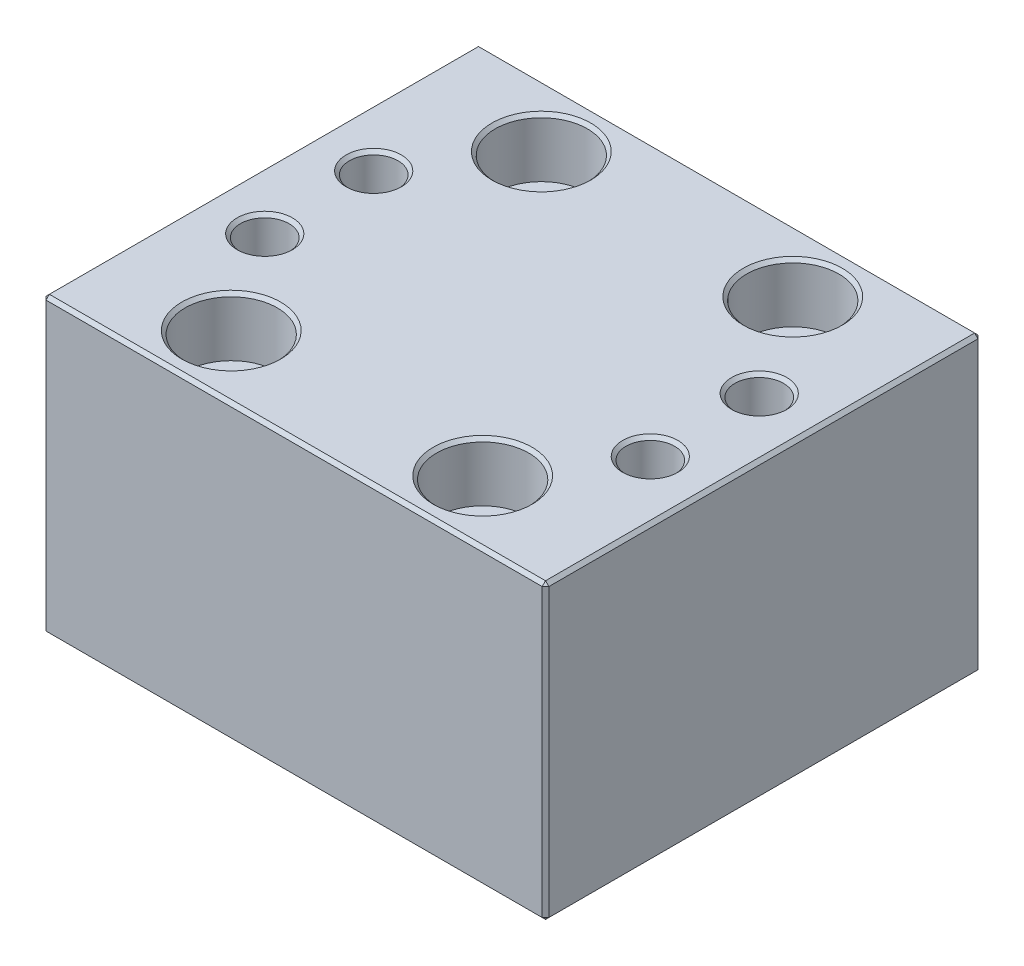
ISO-10303-21;
HEADER;
FILE_DESCRIPTION(('STEP AP214'),'2;1');
FILE_NAME('part.step','',(''),(''),'','','');
FILE_SCHEMA(('AUTOMOTIVE_DESIGN { 1 0 10303 214 1 1 1 1 }'));
ENDSEC;
DATA;
#1=APPLICATION_CONTEXT('core data for automotive mechanical design processes');
#2=APPLICATION_PROTOCOL_DEFINITION('international standard','automotive_design',2000,#1);
#3=PRODUCT_CONTEXT('',#1,'mechanical');
#4=PRODUCT('Part','Part','',(#3));
#5=PRODUCT_RELATED_PRODUCT_CATEGORY('part','',(#4));
#6=PRODUCT_DEFINITION_FORMATION('','',#4);
#7=PRODUCT_DEFINITION_CONTEXT('part definition',#1,'design');
#8=PRODUCT_DEFINITION('design','',#6,#7);
#9=PRODUCT_DEFINITION_SHAPE('','',#8);
#10=(LENGTH_UNIT() NAMED_UNIT(*) SI_UNIT(.MILLI.,.METRE.));
#11=(NAMED_UNIT(*) PLANE_ANGLE_UNIT() SI_UNIT($,.RADIAN.));
#12=(NAMED_UNIT(*) SI_UNIT($,.STERADIAN.) SOLID_ANGLE_UNIT());
#13=UNCERTAINTY_MEASURE_WITH_UNIT(LENGTH_MEASURE(1.E-05),#10,'distance_accuracy_value','');
#14=(GEOMETRIC_REPRESENTATION_CONTEXT(3) GLOBAL_UNCERTAINTY_ASSIGNED_CONTEXT((#13)) GLOBAL_UNIT_ASSIGNED_CONTEXT((#10,
#11,#12)) REPRESENTATION_CONTEXT('',''));
#15=CARTESIAN_POINT('',(0.,0.,0.));
#16=DIRECTION('',(0.,0.,1.));
#17=DIRECTION('',(1.,0.,0.));
#18=AXIS2_PLACEMENT_3D('',#15,#16,#17);
#19=CARTESIAN_POINT('',(-15.,35.,-18.5));
#20=DIRECTION('',(0.,-1.,0.));
#21=DIRECTION('',(0.,0.,-1.));
#22=AXIS2_PLACEMENT_3D('',#19,#20,#21);
#23=CYLINDRICAL_SURFACE('',#22,3.05);
#24=CARTESIAN_POINT('',(-15.,0.,-18.5));
#25=DIRECTION('',(0.,1.,0.));
#26=DIRECTION('',(0.,0.,1.));
#27=AXIS2_PLACEMENT_3D('',#24,#25,#26);
#28=CIRCLE('',#27,3.05);
#29=CARTESIAN_POINT('',(-15.,0.,-15.45));
#30=VERTEX_POINT('',#29);
#31=EDGE_CURVE('E319',#30,#30,#28,.T.);
#32=ORIENTED_EDGE('',*,*,#31,.F.);
#33=EDGE_LOOP('',(#32));
#34=FACE_BOUND('',#33,.T.);
#35=CARTESIAN_POINT('',(-15.,28.,-18.5));
#36=DIRECTION('',(0.,1.,0.));
#37=DIRECTION('',(0.,0.,1.));
#38=AXIS2_PLACEMENT_3D('',#35,#36,#37);
#39=CIRCLE('',#38,3.05);
#40=CARTESIAN_POINT('',(-15.,28.,-15.45));
#41=VERTEX_POINT('',#40);
#42=EDGE_CURVE('E313',#41,#41,#39,.T.);
#43=ORIENTED_EDGE('',*,*,#42,.T.);
#44=EDGE_LOOP('',(#43));
#45=FACE_BOUND('',#44,.T.);
#46=ADVANCED_FACE('F36',(#34,#45),#23,.F.);
#47=CARTESIAN_POINT('',(15.,35.,-18.5));
#48=DIRECTION('',(0.,-1.,0.));
#49=DIRECTION('',(0.,0.,-1.));
#50=AXIS2_PLACEMENT_3D('',#47,#48,#49);
#51=CYLINDRICAL_SURFACE('',#50,3.05000000000001);
#52=CARTESIAN_POINT('',(15.,0.,-18.5));
#53=DIRECTION('',(0.,1.,0.));
#54=DIRECTION('',(0.,0.,1.));
#55=AXIS2_PLACEMENT_3D('',#52,#53,#54);
#56=CIRCLE('',#55,3.05000000000001);
#57=CARTESIAN_POINT('',(15.,0.,-15.45));
#58=VERTEX_POINT('',#57);
#59=EDGE_CURVE('E316',#58,#58,#56,.T.);
#60=ORIENTED_EDGE('',*,*,#59,.F.);
#61=EDGE_LOOP('',(#60));
#62=FACE_BOUND('',#61,.T.);
#63=CARTESIAN_POINT('',(15.,28.,-18.5));
#64=DIRECTION('',(0.,1.,0.));
#65=DIRECTION('',(0.,0.,1.));
#66=AXIS2_PLACEMENT_3D('',#63,#64,#65);
#67=CIRCLE('',#66,3.05000000000001);
#68=CARTESIAN_POINT('',(15.,28.,-15.45));
#69=VERTEX_POINT('',#68);
#70=EDGE_CURVE('E340',#69,#69,#67,.T.);
#71=ORIENTED_EDGE('',*,*,#70,.T.);
#72=EDGE_LOOP('',(#71));
#73=FACE_BOUND('',#72,.T.);
#74=ADVANCED_FACE('F407',(#62,#73),#51,.F.);
#75=CARTESIAN_POINT('',(15.,35.,18.5));
#76=DIRECTION('',(0.,-1.,0.));
#77=DIRECTION('',(0.,0.,-1.));
#78=AXIS2_PLACEMENT_3D('',#75,#76,#77);
#79=CYLINDRICAL_SURFACE('',#78,3.05000000000001);
#80=CARTESIAN_POINT('',(15.,0.,18.5));
#81=DIRECTION('',(0.,1.,0.));
#82=DIRECTION('',(0.,0.,1.));
#83=AXIS2_PLACEMENT_3D('',#80,#81,#82);
#84=CIRCLE('',#83,3.05000000000001);
#85=CARTESIAN_POINT('',(15.,0.,21.55));
#86=VERTEX_POINT('',#85);
#87=EDGE_CURVE('E312',#86,#86,#84,.T.);
#88=ORIENTED_EDGE('',*,*,#87,.F.);
#89=EDGE_LOOP('',(#88));
#90=FACE_BOUND('',#89,.T.);
#91=CARTESIAN_POINT('',(15.,28.,18.5));
#92=DIRECTION('',(0.,1.,0.));
#93=DIRECTION('',(0.,0.,1.));
#94=AXIS2_PLACEMENT_3D('',#91,#92,#93);
#95=CIRCLE('',#94,3.05000000000001);
#96=CARTESIAN_POINT('',(15.,28.,21.55));
#97=VERTEX_POINT('',#96);
#98=EDGE_CURVE('E337',#97,#97,#95,.T.);
#99=ORIENTED_EDGE('',*,*,#98,.T.);
#100=EDGE_LOOP('',(#99));
#101=FACE_BOUND('',#100,.T.);
#102=ADVANCED_FACE('F413',(#90,#101),#79,.F.);
#103=CARTESIAN_POINT('',(-15.,35.,18.5));
#104=DIRECTION('',(0.,-1.,0.));
#105=DIRECTION('',(0.,0.,-1.));
#106=AXIS2_PLACEMENT_3D('',#103,#104,#105);
#107=CYLINDRICAL_SURFACE('',#106,3.05);
#108=CARTESIAN_POINT('',(-15.,0.,18.5));
#109=DIRECTION('',(0.,1.,0.));
#110=DIRECTION('',(0.,0.,1.));
#111=AXIS2_PLACEMENT_3D('',#108,#109,#110);
#112=CIRCLE('',#111,3.05);
#113=CARTESIAN_POINT('',(-15.,0.,21.55));
#114=VERTEX_POINT('',#113);
#115=EDGE_CURVE('E309',#114,#114,#112,.T.);
#116=ORIENTED_EDGE('',*,*,#115,.F.);
#117=EDGE_LOOP('',(#116));
#118=FACE_BOUND('',#117,.T.);
#119=CARTESIAN_POINT('',(-15.,28.,18.5));
#120=DIRECTION('',(0.,1.,0.));
#121=DIRECTION('',(0.,0.,1.));
#122=AXIS2_PLACEMENT_3D('',#119,#120,#121);
#123=CIRCLE('',#122,3.05);
#124=CARTESIAN_POINT('',(-15.,28.,21.55));
#125=VERTEX_POINT('',#124);
#126=EDGE_CURVE('E308',#125,#125,#123,.T.);
#127=ORIENTED_EDGE('',*,*,#126,.T.);
#128=EDGE_LOOP('',(#127));
#129=FACE_BOUND('',#128,.T.);
#130=ADVANCED_FACE('F440',(#118,#129),#107,.F.);
#131=CARTESIAN_POINT('',(0.,35.,0.));
#132=DIRECTION('',(0.,1.,0.));
#133=DIRECTION('',(0.,0.,1.));
#134=AXIS2_PLACEMENT_3D('',#131,#132,#133);
#135=PLANE('',#134);
#136=CARTESIAN_POINT('',(-23.,35.,6.5));
#137=DIRECTION('',(0.,1.,0.));
#138=DIRECTION('',(0.,0.,1.));
#139=AXIS2_PLACEMENT_3D('',#136,#137,#138);
#140=CIRCLE('',#139,3.3);
#141=CARTESIAN_POINT('',(-23.,35.,9.8));
#142=VERTEX_POINT('',#141);
#143=EDGE_CURVE('E172',#142,#142,#140,.F.);
#144=ORIENTED_EDGE('',*,*,#143,.T.);
#145=EDGE_LOOP('',(#144));
#146=FACE_BOUND('',#145,.T.);
#147=CARTESIAN_POINT('',(23.,35.,-6.5));
#148=DIRECTION('',(0.,1.,0.));
#149=DIRECTION('',(0.,0.,1.));
#150=AXIS2_PLACEMENT_3D('',#147,#148,#149);
#151=CIRCLE('',#150,3.30000000000001);
#152=CARTESIAN_POINT('',(23.,35.,-3.2));
#153=VERTEX_POINT('',#152);
#154=EDGE_CURVE('E169',#153,#153,#151,.F.);
#155=ORIENTED_EDGE('',*,*,#154,.T.);
#156=EDGE_LOOP('',(#155));
#157=FACE_BOUND('',#156,.T.);
#158=DIRECTION('',(0.,0.,-1.));
#159=VECTOR('',#158,1.);
#160=CARTESIAN_POINT('',(29.6,35.,-26.));
#161=LINE('',#160,#159);
#162=CARTESIAN_POINT('',(29.6,35.,25.6));
#163=VERTEX_POINT('',#162);
#164=CARTESIAN_POINT('',(29.6,35.,-25.6));
#165=VERTEX_POINT('',#164);
#166=EDGE_CURVE('E168',#163,#165,#161,.T.);
#167=ORIENTED_EDGE('',*,*,#166,.T.);
#168=DIRECTION('',(-1.,0.,0.));
#169=VECTOR('',#168,1.);
#170=CARTESIAN_POINT('',(-30.,35.,-25.6));
#171=LINE('',#170,#169);
#172=CARTESIAN_POINT('',(-29.6,35.,-25.6));
#173=VERTEX_POINT('',#172);
#174=EDGE_CURVE('E150',#165,#173,#171,.T.);
#175=ORIENTED_EDGE('',*,*,#174,.T.);
#176=DIRECTION('',(0.,0.,1.));
#177=VECTOR('',#176,1.);
#178=CARTESIAN_POINT('',(-29.6,35.,26.));
#179=LINE('',#178,#177);
#180=CARTESIAN_POINT('',(-29.6,35.,25.6));
#181=VERTEX_POINT('',#180);
#182=EDGE_CURVE('E156',#173,#181,#179,.T.);
#183=ORIENTED_EDGE('',*,*,#182,.T.);
#184=DIRECTION('',(1.,0.,0.));
#185=VECTOR('',#184,1.);
#186=CARTESIAN_POINT('',(30.,35.,25.6));
#187=LINE('',#186,#185);
#188=EDGE_CURVE('E162',#181,#163,#187,.T.);
#189=ORIENTED_EDGE('',*,*,#188,.T.);
#190=EDGE_LOOP('',(#167,#175,#183,#189));
#191=FACE_BOUND('',#190,.T.);
#192=CARTESIAN_POINT('',(-23.,35.,-6.5));
#193=DIRECTION('',(0.,1.,0.));
#194=DIRECTION('',(0.,0.,1.));
#195=AXIS2_PLACEMENT_3D('',#192,#193,#194);
#196=CIRCLE('',#195,3.30000000000001);
#197=CARTESIAN_POINT('',(-23.,35.,-3.19999999999999));
#198=VERTEX_POINT('',#197);
#199=EDGE_CURVE('E163',#198,#198,#196,.F.);
#200=ORIENTED_EDGE('',*,*,#199,.T.);
#201=EDGE_LOOP('',(#200));
#202=FACE_BOUND('',#201,.T.);
#203=CARTESIAN_POINT('',(23.,35.,6.5));
#204=DIRECTION('',(0.,1.,0.));
#205=DIRECTION('',(0.,0.,1.));
#206=AXIS2_PLACEMENT_3D('',#203,#204,#205);
#207=CIRCLE('',#206,3.30000000000001);
#208=CARTESIAN_POINT('',(23.,35.,9.8));
#209=VERTEX_POINT('',#208);
#210=EDGE_CURVE('E359',#209,#209,#207,.F.);
#211=ORIENTED_EDGE('',*,*,#210,.T.);
#212=EDGE_LOOP('',(#211));
#213=FACE_BOUND('',#212,.T.);
#214=CARTESIAN_POINT('',(-15.,35.,-18.5));
#215=DIRECTION('',(0.,1.,0.));
#216=DIRECTION('',(0.,0.,1.));
#217=AXIS2_PLACEMENT_3D('',#214,#215,#216);
#218=CIRCLE('',#217,5.90000000000003);
#219=CARTESIAN_POINT('',(-15.,35.,-12.6));
#220=VERTEX_POINT('',#219);
#221=EDGE_CURVE('E356',#220,#220,#218,.F.);
#222=ORIENTED_EDGE('',*,*,#221,.T.);
#223=EDGE_LOOP('',(#222));
#224=FACE_BOUND('',#223,.T.);
#225=CARTESIAN_POINT('',(15.,35.,-18.5));
#226=DIRECTION('',(0.,1.,0.));
#227=DIRECTION('',(0.,0.,1.));
#228=AXIS2_PLACEMENT_3D('',#225,#226,#227);
#229=CIRCLE('',#228,5.90000000000003);
#230=CARTESIAN_POINT('',(15.,35.,-12.6));
#231=VERTEX_POINT('',#230);
#232=EDGE_CURVE('E353',#231,#231,#229,.F.);
#233=ORIENTED_EDGE('',*,*,#232,.T.);
#234=EDGE_LOOP('',(#233));
#235=FACE_BOUND('',#234,.T.);
#236=CARTESIAN_POINT('',(15.,35.,18.5));
#237=DIRECTION('',(0.,1.,0.));
#238=DIRECTION('',(0.,0.,1.));
#239=AXIS2_PLACEMENT_3D('',#236,#237,#238);
#240=CIRCLE('',#239,5.90000000000001);
#241=CARTESIAN_POINT('',(15.,35.,24.4));
#242=VERTEX_POINT('',#241);
#243=EDGE_CURVE('E350',#242,#242,#240,.F.);
#244=ORIENTED_EDGE('',*,*,#243,.T.);
#245=EDGE_LOOP('',(#244));
#246=FACE_BOUND('',#245,.T.);
#247=CARTESIAN_POINT('',(-15.,35.,18.5));
#248=DIRECTION('',(0.,1.,0.));
#249=DIRECTION('',(0.,0.,1.));
#250=AXIS2_PLACEMENT_3D('',#247,#248,#249);
#251=CIRCLE('',#250,5.90000000000001);
#252=CARTESIAN_POINT('',(-15.,35.,24.4));
#253=VERTEX_POINT('',#252);
#254=EDGE_CURVE('E347',#253,#253,#251,.F.);
#255=ORIENTED_EDGE('',*,*,#254,.T.);
#256=EDGE_LOOP('',(#255));
#257=FACE_BOUND('',#256,.T.);
#258=ADVANCED_FACE('F165',(#146,#157,#191,#202,#213,#224,#235,#246,#257),#135,.T.);
#259=CARTESIAN_POINT('',(0.,0.,0.));
#260=DIRECTION('',(0.,1.,0.));
#261=DIRECTION('',(0.,0.,1.));
#262=AXIS2_PLACEMENT_3D('',#259,#260,#261);
#263=PLANE('',#262);
#264=DIRECTION('',(0.,0.,-1.));
#265=VECTOR('',#264,1.);
#266=CARTESIAN_POINT('',(-29.6,0.,0.));
#267=LINE('',#266,#265);
#268=CARTESIAN_POINT('',(-29.6,0.,25.6));
#269=VERTEX_POINT('',#268);
#270=CARTESIAN_POINT('',(-29.6,0.,-25.6));
#271=VERTEX_POINT('',#270);
#272=EDGE_CURVE('E194',#269,#271,#267,.T.);
#273=ORIENTED_EDGE('',*,*,#272,.T.);
#274=DIRECTION('',(1.,0.,0.));
#275=VECTOR('',#274,1.);
#276=CARTESIAN_POINT('',(0.,0.,-25.6));
#277=LINE('',#276,#275);
#278=CARTESIAN_POINT('',(29.6,0.,-25.6));
#279=VERTEX_POINT('',#278);
#280=EDGE_CURVE('E196',#271,#279,#277,.T.);
#281=ORIENTED_EDGE('',*,*,#280,.T.);
#282=DIRECTION('',(0.,0.,1.));
#283=VECTOR('',#282,1.);
#284=CARTESIAN_POINT('',(29.6,0.,0.));
#285=LINE('',#284,#283);
#286=CARTESIAN_POINT('',(29.6,0.,25.6));
#287=VERTEX_POINT('',#286);
#288=EDGE_CURVE('E192',#279,#287,#285,.T.);
#289=ORIENTED_EDGE('',*,*,#288,.T.);
#290=DIRECTION('',(-1.,0.,0.));
#291=VECTOR('',#290,1.);
#292=CARTESIAN_POINT('',(0.,0.,25.6));
#293=LINE('',#292,#291);
#294=EDGE_CURVE('E190',#287,#269,#293,.T.);
#295=ORIENTED_EDGE('',*,*,#294,.T.);
#296=EDGE_LOOP('',(#273,#281,#289,#295));
#297=FACE_BOUND('',#296,.T.);
#298=CARTESIAN_POINT('',(-23.,0.,-6.5));
#299=DIRECTION('',(0.,1.,0.));
#300=DIRECTION('',(0.,0.,1.));
#301=AXIS2_PLACEMENT_3D('',#298,#299,#300);
#302=CIRCLE('',#301,2.9);
#303=CARTESIAN_POINT('',(-23.,0.,-3.6));
#304=VERTEX_POINT('',#303);
#305=EDGE_CURVE('E331',#304,#304,#302,.T.);
#306=ORIENTED_EDGE('',*,*,#305,.T.);
#307=EDGE_LOOP('',(#306));
#308=FACE_BOUND('',#307,.T.);
#309=CARTESIAN_POINT('',(23.,0.,-6.5));
#310=DIRECTION('',(0.,1.,0.));
#311=DIRECTION('',(0.,0.,1.));
#312=AXIS2_PLACEMENT_3D('',#309,#310,#311);
#313=CIRCLE('',#312,2.9);
#314=CARTESIAN_POINT('',(23.,0.,-3.6));
#315=VERTEX_POINT('',#314);
#316=EDGE_CURVE('E328',#315,#315,#313,.T.);
#317=ORIENTED_EDGE('',*,*,#316,.T.);
#318=EDGE_LOOP('',(#317));
#319=FACE_BOUND('',#318,.T.);
#320=CARTESIAN_POINT('',(23.,0.,6.5));
#321=DIRECTION('',(0.,1.,0.));
#322=DIRECTION('',(0.,0.,1.));
#323=AXIS2_PLACEMENT_3D('',#320,#321,#322);
#324=CIRCLE('',#323,2.9);
#325=CARTESIAN_POINT('',(23.,0.,9.4));
#326=VERTEX_POINT('',#325);
#327=EDGE_CURVE('E325',#326,#326,#324,.T.);
#328=ORIENTED_EDGE('',*,*,#327,.T.);
#329=EDGE_LOOP('',(#328));
#330=FACE_BOUND('',#329,.T.);
#331=CARTESIAN_POINT('',(-23.,0.,6.5));
#332=DIRECTION('',(0.,1.,0.));
#333=DIRECTION('',(0.,0.,1.));
#334=AXIS2_PLACEMENT_3D('',#331,#332,#333);
#335=CIRCLE('',#334,2.9);
#336=CARTESIAN_POINT('',(-23.,0.,9.4));
#337=VERTEX_POINT('',#336);
#338=EDGE_CURVE('E322',#337,#337,#335,.T.);
#339=ORIENTED_EDGE('',*,*,#338,.T.);
#340=EDGE_LOOP('',(#339));
#341=FACE_BOUND('',#340,.T.);
#342=ORIENTED_EDGE('',*,*,#31,.T.);
#343=EDGE_LOOP('',(#342));
#344=FACE_BOUND('',#343,.T.);
#345=ORIENTED_EDGE('',*,*,#59,.T.);
#346=EDGE_LOOP('',(#345));
#347=FACE_BOUND('',#346,.T.);
#348=ORIENTED_EDGE('',*,*,#87,.T.);
#349=EDGE_LOOP('',(#348));
#350=FACE_BOUND('',#349,.T.);
#351=ORIENTED_EDGE('',*,*,#115,.T.);
#352=EDGE_LOOP('',(#351));
#353=FACE_BOUND('',#352,.T.);
#354=ADVANCED_FACE('F439',(#297,#308,#319,#330,#341,#344,#347,#350,#353),#263,.F.);
#355=CARTESIAN_POINT('',(-30.,35.,26.));
#356=DIRECTION('',(1.,0.,0.));
#357=DIRECTION('',(0.,0.,-1.));
#358=AXIS2_PLACEMENT_3D('',#355,#356,#357);
#359=PLANE('',#358);
#360=DIRECTION('',(0.,0.,-1.));
#361=VECTOR('',#360,1.);
#362=CARTESIAN_POINT('',(-30.,34.6,-26.));
#363=LINE('',#362,#361);
#364=CARTESIAN_POINT('',(-30.,34.6,25.6));
#365=VERTEX_POINT('',#364);
#366=CARTESIAN_POINT('',(-30.,34.6,-25.6));
#367=VERTEX_POINT('',#366);
#368=EDGE_CURVE('E199',#365,#367,#363,.T.);
#369=ORIENTED_EDGE('',*,*,#368,.T.);
#370=DIRECTION('',(0.,-1.,0.));
#371=VECTOR('',#370,1.);
#372=CARTESIAN_POINT('',(-30.,35.,-25.6));
#373=LINE('',#372,#371);
#374=CARTESIAN_POINT('',(-30.,0.400000000000011,-25.6));
#375=VERTEX_POINT('',#374);
#376=EDGE_CURVE('E205',#367,#375,#373,.T.);
#377=ORIENTED_EDGE('',*,*,#376,.T.);
#378=DIRECTION('',(0.,0.,1.));
#379=VECTOR('',#378,1.);
#380=CARTESIAN_POINT('',(-30.,0.400000000000011,26.));
#381=LINE('',#380,#379);
#382=CARTESIAN_POINT('',(-30.,0.400000000000011,25.6));
#383=VERTEX_POINT('',#382);
#384=EDGE_CURVE('E203',#375,#383,#381,.T.);
#385=ORIENTED_EDGE('',*,*,#384,.T.);
#386=DIRECTION('',(0.,1.,0.));
#387=VECTOR('',#386,1.);
#388=CARTESIAN_POINT('',(-30.,35.,25.6));
#389=LINE('',#388,#387);
#390=EDGE_CURVE('E201',#383,#365,#389,.T.);
#391=ORIENTED_EDGE('',*,*,#390,.T.);
#392=EDGE_LOOP('',(#369,#377,#385,#391));
#393=FACE_BOUND('',#392,.T.);
#394=ADVANCED_FACE('F389',(#393),#359,.F.);
#395=CARTESIAN_POINT('',(30.,35.,26.));
#396=DIRECTION('',(0.,0.,-1.));
#397=DIRECTION('',(-1.,0.,0.));
#398=AXIS2_PLACEMENT_3D('',#395,#396,#397);
#399=PLANE('',#398);
#400=DIRECTION('',(-1.,0.,0.));
#401=VECTOR('',#400,1.);
#402=CARTESIAN_POINT('',(-30.,34.6,26.));
#403=LINE('',#402,#401);
#404=CARTESIAN_POINT('',(29.6,34.6,26.));
#405=VERTEX_POINT('',#404);
#406=CARTESIAN_POINT('',(-29.6,34.6,26.));
#407=VERTEX_POINT('',#406);
#408=EDGE_CURVE('E217',#405,#407,#403,.T.);
#409=ORIENTED_EDGE('',*,*,#408,.T.);
#410=DIRECTION('',(0.,-1.,0.));
#411=VECTOR('',#410,1.);
#412=CARTESIAN_POINT('',(-29.6,35.,26.));
#413=LINE('',#412,#411);
#414=CARTESIAN_POINT('',(-29.6,0.400000000000011,26.));
#415=VERTEX_POINT('',#414);
#416=EDGE_CURVE('E222',#407,#415,#413,.T.);
#417=ORIENTED_EDGE('',*,*,#416,.T.);
#418=DIRECTION('',(1.,0.,0.));
#419=VECTOR('',#418,1.);
#420=CARTESIAN_POINT('',(30.,0.400000000000011,26.));
#421=LINE('',#420,#419);
#422=CARTESIAN_POINT('',(29.6,0.400000000000011,26.));
#423=VERTEX_POINT('',#422);
#424=EDGE_CURVE('E62',#415,#423,#421,.T.);
#425=ORIENTED_EDGE('',*,*,#424,.T.);
#426=DIRECTION('',(0.,1.,0.));
#427=VECTOR('',#426,1.);
#428=CARTESIAN_POINT('',(29.6,35.,26.));
#429=LINE('',#428,#427);
#430=EDGE_CURVE('E219',#423,#405,#429,.T.);
#431=ORIENTED_EDGE('',*,*,#430,.T.);
#432=EDGE_LOOP('',(#409,#417,#425,#431));
#433=FACE_BOUND('',#432,.T.);
#434=ADVANCED_FACE('F450',(#433),#399,.F.);
#435=CARTESIAN_POINT('',(30.,35.,26.));
#436=DIRECTION('',(-1.,0.,0.));
#437=DIRECTION('',(0.,0.,1.));
#438=AXIS2_PLACEMENT_3D('',#435,#436,#437);
#439=PLANE('',#438);
#440=DIRECTION('',(0.,0.,-1.));
#441=VECTOR('',#440,1.);
#442=CARTESIAN_POINT('',(30.,0.400000000000011,26.));
#443=LINE('',#442,#441);
#444=CARTESIAN_POINT('',(30.,0.400000000000011,25.6));
#445=VERTEX_POINT('',#444);
#446=CARTESIAN_POINT('',(30.,0.400000000000011,-25.6));
#447=VERTEX_POINT('',#446);
#448=EDGE_CURVE('E212',#445,#447,#443,.T.);
#449=ORIENTED_EDGE('',*,*,#448,.T.);
#450=DIRECTION('',(0.,1.,0.));
#451=VECTOR('',#450,1.);
#452=CARTESIAN_POINT('',(30.,35.,-25.6));
#453=LINE('',#452,#451);
#454=CARTESIAN_POINT('',(30.,34.6,-25.6));
#455=VERTEX_POINT('',#454);
#456=EDGE_CURVE('E214',#447,#455,#453,.T.);
#457=ORIENTED_EDGE('',*,*,#456,.T.);
#458=DIRECTION('',(0.,0.,1.));
#459=VECTOR('',#458,1.);
#460=CARTESIAN_POINT('',(30.,34.6,26.));
#461=LINE('',#460,#459);
#462=CARTESIAN_POINT('',(30.,34.6,25.6));
#463=VERTEX_POINT('',#462);
#464=EDGE_CURVE('E208',#455,#463,#461,.T.);
#465=ORIENTED_EDGE('',*,*,#464,.T.);
#466=DIRECTION('',(0.,-1.,0.));
#467=VECTOR('',#466,1.);
#468=CARTESIAN_POINT('',(30.,35.,25.6));
#469=LINE('',#468,#467);
#470=EDGE_CURVE('E210',#463,#445,#469,.T.);
#471=ORIENTED_EDGE('',*,*,#470,.T.);
#472=EDGE_LOOP('',(#449,#457,#465,#471));
#473=FACE_BOUND('',#472,.T.);
#474=ADVANCED_FACE('F447',(#473),#439,.F.);
#475=CARTESIAN_POINT('',(30.,35.,-26.));
#476=DIRECTION('',(0.,0.,1.));
#477=DIRECTION('',(1.,0.,0.));
#478=AXIS2_PLACEMENT_3D('',#475,#476,#477);
#479=PLANE('',#478);
#480=DIRECTION('',(0.,-1.,0.));
#481=VECTOR('',#480,1.);
#482=CARTESIAN_POINT('',(29.6,35.,-26.));
#483=LINE('',#482,#481);
#484=CARTESIAN_POINT('',(29.6,34.6,-26.));
#485=VERTEX_POINT('',#484);
#486=CARTESIAN_POINT('',(29.6,0.400000000000011,-26.));
#487=VERTEX_POINT('',#486);
#488=EDGE_CURVE('E183',#485,#487,#483,.T.);
#489=ORIENTED_EDGE('',*,*,#488,.T.);
#490=DIRECTION('',(-1.,0.,0.));
#491=VECTOR('',#490,1.);
#492=CARTESIAN_POINT('',(30.,0.400000000000011,-26.));
#493=LINE('',#492,#491);
#494=CARTESIAN_POINT('',(-29.6,0.400000000000011,-26.));
#495=VERTEX_POINT('',#494);
#496=EDGE_CURVE('E187',#487,#495,#493,.T.);
#497=ORIENTED_EDGE('',*,*,#496,.T.);
#498=DIRECTION('',(0.,1.,0.));
#499=VECTOR('',#498,1.);
#500=CARTESIAN_POINT('',(-29.6,35.,-26.));
#501=LINE('',#500,#499);
#502=CARTESIAN_POINT('',(-29.6,34.6,-26.));
#503=VERTEX_POINT('',#502);
#504=EDGE_CURVE('E185',#495,#503,#501,.T.);
#505=ORIENTED_EDGE('',*,*,#504,.T.);
#506=DIRECTION('',(1.,0.,0.));
#507=VECTOR('',#506,1.);
#508=CARTESIAN_POINT('',(30.,34.6,-26.));
#509=LINE('',#508,#507);
#510=EDGE_CURVE('E152',#503,#485,#509,.T.);
#511=ORIENTED_EDGE('',*,*,#510,.T.);
#512=EDGE_LOOP('',(#489,#497,#505,#511));
#513=FACE_BOUND('',#512,.T.);
#514=ADVANCED_FACE('F381',(#513),#479,.F.);
#515=CARTESIAN_POINT('',(-23.,35.,-6.5));
#516=DIRECTION('',(0.,-1.,0.));
#517=DIRECTION('',(0.,0.,-1.));
#518=AXIS2_PLACEMENT_3D('',#515,#516,#517);
#519=CYLINDRICAL_SURFACE('',#518,2.9);
#520=CARTESIAN_POINT('',(-23.,34.6,-6.5));
#521=DIRECTION('',(0.,1.,0.));
#522=DIRECTION('',(0.,0.,1.));
#523=AXIS2_PLACEMENT_3D('',#520,#521,#522);
#524=CIRCLE('',#523,2.9);
#525=CARTESIAN_POINT('',(-23.,34.6,-3.6));
#526=VERTEX_POINT('',#525);
#527=EDGE_CURVE('E224',#526,#526,#524,.T.);
#528=ORIENTED_EDGE('',*,*,#527,.T.);
#529=EDGE_LOOP('',(#528));
#530=FACE_BOUND('',#529,.T.);
#531=ORIENTED_EDGE('',*,*,#305,.F.);
#532=EDGE_LOOP('',(#531));
#533=FACE_BOUND('',#532,.T.);
#534=ADVANCED_FACE('F432',(#530,#533),#519,.F.);
#535=CARTESIAN_POINT('',(23.,35.,-6.5));
#536=DIRECTION('',(0.,-1.,0.));
#537=DIRECTION('',(0.,0.,-1.));
#538=AXIS2_PLACEMENT_3D('',#535,#536,#537);
#539=CYLINDRICAL_SURFACE('',#538,2.9);
#540=CARTESIAN_POINT('',(23.,34.6,-6.5));
#541=DIRECTION('',(0.,1.,0.));
#542=DIRECTION('',(0.,0.,1.));
#543=AXIS2_PLACEMENT_3D('',#540,#541,#542);
#544=CIRCLE('',#543,2.9);
#545=CARTESIAN_POINT('',(23.,34.6,-3.6));
#546=VERTEX_POINT('',#545);
#547=EDGE_CURVE('E179',#546,#546,#544,.T.);
#548=ORIENTED_EDGE('',*,*,#547,.T.);
#549=EDGE_LOOP('',(#548));
#550=FACE_BOUND('',#549,.T.);
#551=ORIENTED_EDGE('',*,*,#316,.F.);
#552=EDGE_LOOP('',(#551));
#553=FACE_BOUND('',#552,.T.);
#554=ADVANCED_FACE('F428',(#550,#553),#539,.F.);
#555=CARTESIAN_POINT('',(23.,35.,6.5));
#556=DIRECTION('',(0.,-1.,0.));
#557=DIRECTION('',(0.,0.,-1.));
#558=AXIS2_PLACEMENT_3D('',#555,#556,#557);
#559=CYLINDRICAL_SURFACE('',#558,2.9);
#560=CARTESIAN_POINT('',(23.,34.6,6.5));
#561=DIRECTION('',(0.,1.,0.));
#562=DIRECTION('',(0.,0.,1.));
#563=AXIS2_PLACEMENT_3D('',#560,#561,#562);
#564=CIRCLE('',#563,2.9);
#565=CARTESIAN_POINT('',(23.,34.6,9.4));
#566=VERTEX_POINT('',#565);
#567=EDGE_CURVE('E227',#566,#566,#564,.T.);
#568=ORIENTED_EDGE('',*,*,#567,.T.);
#569=EDGE_LOOP('',(#568));
#570=FACE_BOUND('',#569,.T.);
#571=ORIENTED_EDGE('',*,*,#327,.F.);
#572=EDGE_LOOP('',(#571));
#573=FACE_BOUND('',#572,.T.);
#574=ADVANCED_FACE('F424',(#570,#573),#559,.F.);
#575=CARTESIAN_POINT('',(-23.,35.,6.5));
#576=DIRECTION('',(0.,-1.,0.));
#577=DIRECTION('',(0.,0.,-1.));
#578=AXIS2_PLACEMENT_3D('',#575,#576,#577);
#579=CYLINDRICAL_SURFACE('',#578,2.9);
#580=CARTESIAN_POINT('',(-23.,34.6,6.5));
#581=DIRECTION('',(0.,1.,0.));
#582=DIRECTION('',(0.,0.,1.));
#583=AXIS2_PLACEMENT_3D('',#580,#581,#582);
#584=CIRCLE('',#583,2.9);
#585=CARTESIAN_POINT('',(-23.,34.6,9.4));
#586=VERTEX_POINT('',#585);
#587=EDGE_CURVE('E334',#586,#586,#584,.T.);
#588=ORIENTED_EDGE('',*,*,#587,.T.);
#589=EDGE_LOOP('',(#588));
#590=FACE_BOUND('',#589,.T.);
#591=ORIENTED_EDGE('',*,*,#338,.F.);
#592=EDGE_LOOP('',(#591));
#593=FACE_BOUND('',#592,.T.);
#594=ADVANCED_FACE('F420',(#590,#593),#579,.F.);
#595=CARTESIAN_POINT('',(-15.,28.,18.5));
#596=DIRECTION('',(0.,1.,0.));
#597=DIRECTION('',(0.,0.,1.));
#598=AXIS2_PLACEMENT_3D('',#595,#596,#597);
#599=CYLINDRICAL_SURFACE('',#598,5.5);
#600=CARTESIAN_POINT('',(-15.,34.6,18.5));
#601=DIRECTION('',(0.,1.,0.));
#602=DIRECTION('',(0.,0.,1.));
#603=AXIS2_PLACEMENT_3D('',#600,#601,#602);
#604=CIRCLE('',#603,5.5);
#605=CARTESIAN_POINT('',(-15.,34.6,24.));
#606=VERTEX_POINT('',#605);
#607=EDGE_CURVE('E11',#606,#606,#604,.T.);
#608=ORIENTED_EDGE('',*,*,#607,.T.);
#609=EDGE_LOOP('',(#608));
#610=FACE_BOUND('',#609,.T.);
#611=CARTESIAN_POINT('',(-15.,28.,18.5));
#612=DIRECTION('',(0.,1.,0.));
#613=DIRECTION('',(0.,0.,1.));
#614=AXIS2_PLACEMENT_3D('',#611,#612,#613);
#615=CIRCLE('',#614,5.5);
#616=CARTESIAN_POINT('',(-15.,28.,24.));
#617=VERTEX_POINT('',#616);
#618=EDGE_CURVE('E290',#617,#617,#615,.T.);
#619=ORIENTED_EDGE('',*,*,#618,.F.);
#620=EDGE_LOOP('',(#619));
#621=FACE_BOUND('',#620,.T.);
#622=ADVANCED_FACE('F423',(#610,#621),#599,.F.);
#623=CARTESIAN_POINT('',(-15.,28.,18.5));
#624=DIRECTION('',(0.,1.,0.));
#625=DIRECTION('',(0.,0.,1.));
#626=AXIS2_PLACEMENT_3D('',#623,#624,#625);
#627=PLANE('',#626);
#628=ORIENTED_EDGE('',*,*,#126,.F.);
#629=EDGE_LOOP('',(#628));
#630=FACE_BOUND('',#629,.T.);
#631=ORIENTED_EDGE('',*,*,#618,.T.);
#632=EDGE_LOOP('',(#631));
#633=FACE_BOUND('',#632,.T.);
#634=ADVANCED_FACE('F624',(#630,#633),#627,.T.);
#635=CARTESIAN_POINT('',(15.,28.,18.5));
#636=DIRECTION('',(0.,1.,0.));
#637=DIRECTION('',(0.,0.,1.));
#638=AXIS2_PLACEMENT_3D('',#635,#636,#637);
#639=CYLINDRICAL_SURFACE('',#638,5.5);
#640=CARTESIAN_POINT('',(15.,34.6,18.5));
#641=DIRECTION('',(0.,1.,0.));
#642=DIRECTION('',(0.,0.,1.));
#643=AXIS2_PLACEMENT_3D('',#640,#641,#642);
#644=CIRCLE('',#643,5.5);
#645=CARTESIAN_POINT('',(15.,34.6,24.));
#646=VERTEX_POINT('',#645);
#647=EDGE_CURVE('E46',#646,#646,#644,.T.);
#648=ORIENTED_EDGE('',*,*,#647,.T.);
#649=EDGE_LOOP('',(#648));
#650=FACE_BOUND('',#649,.T.);
#651=CARTESIAN_POINT('',(15.,28.,18.5));
#652=DIRECTION('',(0.,1.,0.));
#653=DIRECTION('',(0.,0.,1.));
#654=AXIS2_PLACEMENT_3D('',#651,#652,#653);
#655=CIRCLE('',#654,5.5);
#656=CARTESIAN_POINT('',(15.,28.,24.));
#657=VERTEX_POINT('',#656);
#658=EDGE_CURVE('E296',#657,#657,#655,.T.);
#659=ORIENTED_EDGE('',*,*,#658,.F.);
#660=EDGE_LOOP('',(#659));
#661=FACE_BOUND('',#660,.T.);
#662=ADVANCED_FACE('F620',(#650,#661),#639,.F.);
#663=CARTESIAN_POINT('',(15.,28.,18.5));
#664=DIRECTION('',(0.,1.,0.));
#665=DIRECTION('',(0.,0.,1.));
#666=AXIS2_PLACEMENT_3D('',#663,#664,#665);
#667=PLANE('',#666);
#668=ORIENTED_EDGE('',*,*,#98,.F.);
#669=EDGE_LOOP('',(#668));
#670=FACE_BOUND('',#669,.T.);
#671=ORIENTED_EDGE('',*,*,#658,.T.);
#672=EDGE_LOOP('',(#671));
#673=FACE_BOUND('',#672,.T.);
#674=ADVANCED_FACE('F623',(#670,#673),#667,.T.);
#675=CARTESIAN_POINT('',(15.,28.,-18.5));
#676=DIRECTION('',(0.,1.,0.));
#677=DIRECTION('',(0.,0.,1.));
#678=AXIS2_PLACEMENT_3D('',#675,#676,#677);
#679=CYLINDRICAL_SURFACE('',#678,5.5);
#680=CARTESIAN_POINT('',(15.,34.6,-18.5));
#681=DIRECTION('',(0.,1.,0.));
#682=DIRECTION('',(0.,0.,1.));
#683=AXIS2_PLACEMENT_3D('',#680,#681,#682);
#684=CIRCLE('',#683,5.5);
#685=CARTESIAN_POINT('',(15.,34.6,-13.));
#686=VERTEX_POINT('',#685);
#687=EDGE_CURVE('E233',#686,#686,#684,.T.);
#688=ORIENTED_EDGE('',*,*,#687,.T.);
#689=EDGE_LOOP('',(#688));
#690=FACE_BOUND('',#689,.T.);
#691=CARTESIAN_POINT('',(15.,28.,-18.5));
#692=DIRECTION('',(0.,1.,0.));
#693=DIRECTION('',(0.,0.,1.));
#694=AXIS2_PLACEMENT_3D('',#691,#692,#693);
#695=CIRCLE('',#694,5.5);
#696=CARTESIAN_POINT('',(15.,28.,-13.));
#697=VERTEX_POINT('',#696);
#698=EDGE_CURVE('E301',#697,#697,#695,.T.);
#699=ORIENTED_EDGE('',*,*,#698,.F.);
#700=EDGE_LOOP('',(#699));
#701=FACE_BOUND('',#700,.T.);
#702=ADVANCED_FACE('F629',(#690,#701),#679,.F.);
#703=CARTESIAN_POINT('',(15.,28.,-18.5));
#704=DIRECTION('',(0.,1.,0.));
#705=DIRECTION('',(0.,0.,1.));
#706=AXIS2_PLACEMENT_3D('',#703,#704,#705);
#707=PLANE('',#706);
#708=ORIENTED_EDGE('',*,*,#70,.F.);
#709=EDGE_LOOP('',(#708));
#710=FACE_BOUND('',#709,.T.);
#711=ORIENTED_EDGE('',*,*,#698,.T.);
#712=EDGE_LOOP('',(#711));
#713=FACE_BOUND('',#712,.T.);
#714=ADVANCED_FACE('F635',(#710,#713),#707,.T.);
#715=CARTESIAN_POINT('',(-15.,28.,-18.5));
#716=DIRECTION('',(0.,1.,0.));
#717=DIRECTION('',(0.,0.,1.));
#718=AXIS2_PLACEMENT_3D('',#715,#716,#717);
#719=CYLINDRICAL_SURFACE('',#718,5.5);
#720=CARTESIAN_POINT('',(-15.,34.6,-18.5));
#721=DIRECTION('',(0.,1.,0.));
#722=DIRECTION('',(0.,0.,1.));
#723=AXIS2_PLACEMENT_3D('',#720,#721,#722);
#724=CIRCLE('',#723,5.5);
#725=CARTESIAN_POINT('',(-15.,34.6,-13.));
#726=VERTEX_POINT('',#725);
#727=EDGE_CURVE('E230',#726,#726,#724,.T.);
#728=ORIENTED_EDGE('',*,*,#727,.T.);
#729=EDGE_LOOP('',(#728));
#730=FACE_BOUND('',#729,.T.);
#731=CARTESIAN_POINT('',(-15.,28.,-18.5));
#732=DIRECTION('',(0.,1.,0.));
#733=DIRECTION('',(0.,0.,1.));
#734=AXIS2_PLACEMENT_3D('',#731,#732,#733);
#735=CIRCLE('',#734,5.5);
#736=CARTESIAN_POINT('',(-15.,28.,-13.));
#737=VERTEX_POINT('',#736);
#738=EDGE_CURVE('E305',#737,#737,#735,.T.);
#739=ORIENTED_EDGE('',*,*,#738,.F.);
#740=EDGE_LOOP('',(#739));
#741=FACE_BOUND('',#740,.T.);
#742=ADVANCED_FACE('F649',(#730,#741),#719,.F.);
#743=CARTESIAN_POINT('',(-15.,28.,-18.5));
#744=DIRECTION('',(0.,1.,0.));
#745=DIRECTION('',(0.,0.,1.));
#746=AXIS2_PLACEMENT_3D('',#743,#744,#745);
#747=PLANE('',#746);
#748=ORIENTED_EDGE('',*,*,#42,.F.);
#749=EDGE_LOOP('',(#748));
#750=FACE_BOUND('',#749,.T.);
#751=ORIENTED_EDGE('',*,*,#738,.T.);
#752=EDGE_LOOP('',(#751));
#753=FACE_BOUND('',#752,.T.);
#754=ADVANCED_FACE('F464',(#750,#753),#747,.T.);
#755=CARTESIAN_POINT('',(-23.,34.6,6.5));
#756=DIRECTION('',(0.,1.,0.));
#757=DIRECTION('',(0.,0.,1.));
#758=AXIS2_PLACEMENT_3D('',#755,#756,#757);
#759=CONICAL_SURFACE('',#758,2.9,0.785398163397456);
#760=ORIENTED_EDGE('',*,*,#143,.F.);
#761=EDGE_LOOP('',(#760));
#762=FACE_BOUND('',#761,.T.);
#763=ORIENTED_EDGE('',*,*,#587,.F.);
#764=EDGE_LOOP('',(#763));
#765=FACE_BOUND('',#764,.T.);
#766=ADVANCED_FACE('F457',(#762,#765),#759,.F.);
#767=CARTESIAN_POINT('',(23.,34.6,-6.5));
#768=DIRECTION('',(0.,1.,0.));
#769=DIRECTION('',(0.,0.,1.));
#770=AXIS2_PLACEMENT_3D('',#767,#768,#769);
#771=CONICAL_SURFACE('',#770,2.9,0.785398163397458);
#772=ORIENTED_EDGE('',*,*,#154,.F.);
#773=EDGE_LOOP('',(#772));
#774=FACE_BOUND('',#773,.T.);
#775=ORIENTED_EDGE('',*,*,#547,.F.);
#776=EDGE_LOOP('',(#775));
#777=FACE_BOUND('',#776,.T.);
#778=ADVANCED_FACE('F463',(#774,#777),#771,.F.);
#779=CARTESIAN_POINT('',(0.,35.,25.6));
#780=DIRECTION('',(0.,0.707106781186552,0.707106781186543));
#781=DIRECTION('',(-1.,0.,0.));
#782=AXIS2_PLACEMENT_3D('',#779,#780,#781);
#783=PLANE('',#782);
#784=DIRECTION('',(0.,-0.707106781186543,0.707106781186552));
#785=VECTOR('',#784,1.);
#786=CARTESIAN_POINT('',(29.6,34.6,26.));
#787=LINE('',#786,#785);
#788=EDGE_CURVE('E41',#163,#405,#787,.T.);
#789=ORIENTED_EDGE('',*,*,#788,.F.);
#790=ORIENTED_EDGE('',*,*,#188,.F.);
#791=DIRECTION('',(0.,0.707106781186543,-0.707106781186552));
#792=VECTOR('',#791,1.);
#793=CARTESIAN_POINT('',(-29.6,34.8,25.8));
#794=LINE('',#793,#792);
#795=EDGE_CURVE('E284',#407,#181,#794,.T.);
#796=ORIENTED_EDGE('',*,*,#795,.F.);
#797=ORIENTED_EDGE('',*,*,#408,.F.);
#798=EDGE_LOOP('',(#789,#790,#796,#797));
#799=FACE_BOUND('',#798,.T.);
#800=ADVANCED_FACE('F365',(#799),#783,.T.);
#801=CARTESIAN_POINT('',(29.6,34.6,26.));
#802=DIRECTION('',(0.577350269189623,0.577350269189633,0.577350269189623));
#803=DIRECTION('',(0.,-0.707106781186541,0.707106781186554));
#804=AXIS2_PLACEMENT_3D('',#801,#802,#803);
#805=PLANE('',#804);
#806=DIRECTION('',(-0.707106781186552,0.707106781186543,0.));
#807=VECTOR('',#806,1.);
#808=CARTESIAN_POINT('',(29.8,34.8,25.6));
#809=LINE('',#808,#807);
#810=EDGE_CURVE('E279',#163,#463,#809,.F.);
#811=ORIENTED_EDGE('',*,*,#810,.F.);
#812=ORIENTED_EDGE('',*,*,#788,.T.);
#813=DIRECTION('',(-0.707106781186547,0.,0.707106781186547));
#814=VECTOR('',#813,1.);
#815=CARTESIAN_POINT('',(29.6,34.6,26.));
#816=LINE('',#815,#814);
#817=EDGE_CURVE('E282',#463,#405,#816,.T.);
#818=ORIENTED_EDGE('',*,*,#817,.F.);
#819=EDGE_LOOP('',(#811,#812,#818));
#820=FACE_BOUND('',#819,.T.);
#821=ADVANCED_FACE('F366',(#820),#805,.T.);
#822=CARTESIAN_POINT('',(-30.,34.6,25.6));
#823=DIRECTION('',(-0.577350269189626,0.577350269189631,0.577350269189621));
#824=DIRECTION('',(-0.70710678118655,-0.707106781186544,0.));
#825=AXIS2_PLACEMENT_3D('',#822,#823,#824);
#826=PLANE('',#825);
#827=DIRECTION('',(-0.707106781186544,0.,-0.707106781186551));
#828=VECTOR('',#827,1.);
#829=CARTESIAN_POINT('',(-30.,34.6,25.6));
#830=LINE('',#829,#828);
#831=EDGE_CURVE('E275',#407,#365,#830,.T.);
#832=ORIENTED_EDGE('',*,*,#831,.F.);
#833=ORIENTED_EDGE('',*,*,#795,.T.);
#834=DIRECTION('',(-0.707106781186548,-0.707106781186548,0.));
#835=VECTOR('',#834,1.);
#836=CARTESIAN_POINT('',(-30.,34.6,25.6));
#837=LINE('',#836,#835);
#838=EDGE_CURVE('E159',#365,#181,#837,.F.);
#839=ORIENTED_EDGE('',*,*,#838,.F.);
#840=EDGE_LOOP('',(#832,#833,#839));
#841=FACE_BOUND('',#840,.T.);
#842=ADVANCED_FACE('F394',(#841),#826,.T.);
#843=CARTESIAN_POINT('',(30.,35.,25.6));
#844=DIRECTION('',(-0.707106781186548,0.,-0.707106781186548));
#845=DIRECTION('',(0.,-1.,0.));
#846=AXIS2_PLACEMENT_3D('',#843,#844,#845);
#847=PLANE('',#846);
#848=ORIENTED_EDGE('',*,*,#817,.T.);
#849=ORIENTED_EDGE('',*,*,#430,.F.);
#850=DIRECTION('',(0.707106781186548,0.,-0.707106781186548));
#851=VECTOR('',#850,1.);
#852=CARTESIAN_POINT('',(29.8,0.400000000000012,25.8));
#853=LINE('',#852,#851);
#854=EDGE_CURVE('E269',#445,#423,#853,.F.);
#855=ORIENTED_EDGE('',*,*,#854,.F.);
#856=ORIENTED_EDGE('',*,*,#470,.F.);
#857=EDGE_LOOP('',(#848,#849,#855,#856));
#858=FACE_BOUND('',#857,.T.);
#859=ADVANCED_FACE('F396',(#858),#847,.F.);
#860=CARTESIAN_POINT('',(29.6,35.,0.));
#861=DIRECTION('',(0.707106781186543,0.707106781186552,0.));
#862=DIRECTION('',(0.,0.,1.));
#863=AXIS2_PLACEMENT_3D('',#860,#861,#862);
#864=PLANE('',#863);
#865=ORIENTED_EDGE('',*,*,#810,.T.);
#866=ORIENTED_EDGE('',*,*,#464,.F.);
#867=DIRECTION('',(0.707106781186552,-0.707106781186543,0.));
#868=VECTOR('',#867,1.);
#869=CARTESIAN_POINT('',(30.,34.6,-25.6));
#870=LINE('',#869,#868);
#871=EDGE_CURVE('E266',#165,#455,#870,.T.);
#872=ORIENTED_EDGE('',*,*,#871,.F.);
#873=ORIENTED_EDGE('',*,*,#166,.F.);
#874=EDGE_LOOP('',(#865,#866,#872,#873));
#875=FACE_BOUND('',#874,.T.);
#876=ADVANCED_FACE('F370',(#875),#864,.T.);
#877=CARTESIAN_POINT('',(0.,35.,-25.6));
#878=DIRECTION('',(0.,0.707106781186546,-0.707106781186549));
#879=DIRECTION('',(1.,0.,0.));
#880=AXIS2_PLACEMENT_3D('',#877,#878,#879);
#881=PLANE('',#880);
#882=DIRECTION('',(0.,-0.707106781186549,-0.707106781186546));
#883=VECTOR('',#882,1.);
#884=CARTESIAN_POINT('',(-29.6,34.6,-26.));
#885=LINE('',#884,#883);
#886=EDGE_CURVE('E135',#173,#503,#885,.T.);
#887=ORIENTED_EDGE('',*,*,#886,.F.);
#888=ORIENTED_EDGE('',*,*,#174,.F.);
#889=DIRECTION('',(0.,0.707106781186549,0.707106781186546));
#890=VECTOR('',#889,1.);
#891=CARTESIAN_POINT('',(29.6,34.8,-25.8));
#892=LINE('',#891,#890);
#893=EDGE_CURVE('E153',#485,#165,#892,.T.);
#894=ORIENTED_EDGE('',*,*,#893,.F.);
#895=ORIENTED_EDGE('',*,*,#510,.F.);
#896=EDGE_LOOP('',(#887,#888,#894,#895));
#897=FACE_BOUND('',#896,.T.);
#898=ADVANCED_FACE('F147',(#897),#881,.T.);
#899=CARTESIAN_POINT('',(-29.6,35.,0.));
#900=DIRECTION('',(-0.707106781186548,0.707106781186548,0.));
#901=DIRECTION('',(0.,0.,-1.));
#902=AXIS2_PLACEMENT_3D('',#899,#900,#901);
#903=PLANE('',#902);
#904=ORIENTED_EDGE('',*,*,#838,.T.);
#905=ORIENTED_EDGE('',*,*,#182,.F.);
#906=DIRECTION('',(0.707106781186548,0.707106781186548,0.));
#907=VECTOR('',#906,1.);
#908=CARTESIAN_POINT('',(-29.8,34.8,-25.6));
#909=LINE('',#908,#907);
#910=EDGE_CURVE('E132',#367,#173,#909,.T.);
#911=ORIENTED_EDGE('',*,*,#910,.F.);
#912=ORIENTED_EDGE('',*,*,#368,.F.);
#913=EDGE_LOOP('',(#904,#905,#911,#912));
#914=FACE_BOUND('',#913,.T.);
#915=ADVANCED_FACE('F157',(#914),#903,.T.);
#916=CARTESIAN_POINT('',(-29.6,35.,26.));
#917=DIRECTION('',(0.707106781186551,0.,-0.707106781186544));
#918=DIRECTION('',(0.,-1.,0.));
#919=AXIS2_PLACEMENT_3D('',#916,#917,#918);
#920=PLANE('',#919);
#921=ORIENTED_EDGE('',*,*,#831,.T.);
#922=ORIENTED_EDGE('',*,*,#390,.F.);
#923=DIRECTION('',(0.707106781186544,0.,0.707106781186551));
#924=VECTOR('',#923,1.);
#925=CARTESIAN_POINT('',(-30.,0.400000000000011,25.6));
#926=LINE('',#925,#924);
#927=EDGE_CURVE('E142',#415,#383,#926,.F.);
#928=ORIENTED_EDGE('',*,*,#927,.F.);
#929=ORIENTED_EDGE('',*,*,#416,.F.);
#930=EDGE_LOOP('',(#921,#922,#928,#929));
#931=FACE_BOUND('',#930,.T.);
#932=ADVANCED_FACE('F393',(#931),#920,.F.);
#933=CARTESIAN_POINT('',(30.,0.400000000000011,26.));
#934=DIRECTION('',(0.,0.707106781186552,-0.707106781186543));
#935=DIRECTION('',(1.,0.,0.));
#936=AXIS2_PLACEMENT_3D('',#933,#934,#935);
#937=PLANE('',#936);
#938=DIRECTION('',(0.,0.707106781186543,0.707106781186552));
#939=VECTOR('',#938,1.);
#940=CARTESIAN_POINT('',(29.6,0.,25.6));
#941=LINE('',#940,#939);
#942=EDGE_CURVE('E272',#423,#287,#941,.F.);
#943=ORIENTED_EDGE('',*,*,#942,.F.);
#944=ORIENTED_EDGE('',*,*,#424,.F.);
#945=DIRECTION('',(0.,-0.707106781186543,-0.707106781186552));
#946=VECTOR('',#945,1.);
#947=CARTESIAN_POINT('',(-29.6,0.200000000000007,25.8));
#948=LINE('',#947,#946);
#949=EDGE_CURVE('E54',#269,#415,#948,.F.);
#950=ORIENTED_EDGE('',*,*,#949,.F.);
#951=ORIENTED_EDGE('',*,*,#294,.F.);
#952=EDGE_LOOP('',(#943,#944,#950,#951));
#953=FACE_BOUND('',#952,.T.);
#954=ADVANCED_FACE('F542',(#953),#937,.F.);
#955=CARTESIAN_POINT('',(29.6,0.,25.6));
#956=DIRECTION('',(0.577350269189622,-0.577350269189632,0.577350269189622));
#957=DIRECTION('',(0.,-0.707106781186541,-0.707106781186554));
#958=AXIS2_PLACEMENT_3D('',#955,#956,#957);
#959=PLANE('',#958);
#960=ORIENTED_EDGE('',*,*,#854,.T.);
#961=ORIENTED_EDGE('',*,*,#942,.T.);
#962=DIRECTION('',(-0.707106781186552,-0.707106781186543,0.));
#963=VECTOR('',#962,1.);
#964=CARTESIAN_POINT('',(29.6,0.,25.6));
#965=LINE('',#964,#963);
#966=EDGE_CURVE('E259',#445,#287,#965,.T.);
#967=ORIENTED_EDGE('',*,*,#966,.F.);
#968=EDGE_LOOP('',(#960,#961,#967));
#969=FACE_BOUND('',#968,.T.);
#970=ADVANCED_FACE('F536',(#969),#959,.T.);
#971=CARTESIAN_POINT('',(30.,34.6,-25.6));
#972=DIRECTION('',(0.577350269189626,0.577350269189626,-0.577350269189626));
#973=DIRECTION('',(0.,0.707106781186547,0.707106781186548));
#974=AXIS2_PLACEMENT_3D('',#971,#972,#973);
#975=PLANE('',#974);
#976=ORIENTED_EDGE('',*,*,#893,.T.);
#977=ORIENTED_EDGE('',*,*,#871,.T.);
#978=DIRECTION('',(0.707106781186547,0.,0.707106781186547));
#979=VECTOR('',#978,1.);
#980=CARTESIAN_POINT('',(30.,34.6,-25.6));
#981=LINE('',#980,#979);
#982=EDGE_CURVE('E257',#485,#455,#981,.T.);
#983=ORIENTED_EDGE('',*,*,#982,.F.);
#984=EDGE_LOOP('',(#976,#977,#983));
#985=FACE_BOUND('',#984,.T.);
#986=ADVANCED_FACE('F373',(#985),#975,.T.);
#987=CARTESIAN_POINT('',(-29.6,34.6,-26.));
#988=DIRECTION('',(-0.577350269189634,0.577350269189619,-0.577350269189624));
#989=DIRECTION('',(-0.707106781186541,0.,0.707106781186554));
#990=AXIS2_PLACEMENT_3D('',#987,#988,#989);
#991=PLANE('',#990);
#992=ORIENTED_EDGE('',*,*,#910,.T.);
#993=ORIENTED_EDGE('',*,*,#886,.T.);
#994=DIRECTION('',(0.707106781186541,0.,-0.707106781186554));
#995=VECTOR('',#994,1.);
#996=CARTESIAN_POINT('',(-29.6,34.6,-26.));
#997=LINE('',#996,#995);
#998=EDGE_CURVE('E137',#367,#503,#997,.T.);
#999=ORIENTED_EDGE('',*,*,#998,.F.);
#1000=EDGE_LOOP('',(#992,#993,#999));
#1001=FACE_BOUND('',#1000,.T.);
#1002=ADVANCED_FACE('F134',(#1001),#991,.T.);
#1003=CARTESIAN_POINT('',(-30.,0.400000000000011,25.6));
#1004=DIRECTION('',(-0.577350269189626,-0.577350269189631,0.577350269189621));
#1005=DIRECTION('',(0.70710678118655,-0.707106781186544,0.));
#1006=AXIS2_PLACEMENT_3D('',#1003,#1004,#1005);
#1007=PLANE('',#1006);
#1008=ORIENTED_EDGE('',*,*,#949,.T.);
#1009=ORIENTED_EDGE('',*,*,#927,.T.);
#1010=DIRECTION('',(-0.707106781186548,0.707106781186548,0.));
#1011=VECTOR('',#1010,1.);
#1012=CARTESIAN_POINT('',(-30.,0.400000000000011,25.6));
#1013=LINE('',#1012,#1011);
#1014=EDGE_CURVE('E253',#269,#383,#1013,.T.);
#1015=ORIENTED_EDGE('',*,*,#1014,.F.);
#1016=EDGE_LOOP('',(#1008,#1009,#1015));
#1017=FACE_BOUND('',#1016,.T.);
#1018=ADVANCED_FACE('F519',(#1017),#1007,.T.);
#1019=CARTESIAN_POINT('',(30.,0.400000000000011,26.));
#1020=DIRECTION('',(-0.707106781186543,0.707106781186552,0.));
#1021=DIRECTION('',(0.,0.,-1.));
#1022=AXIS2_PLACEMENT_3D('',#1019,#1020,#1021);
#1023=PLANE('',#1022);
#1024=ORIENTED_EDGE('',*,*,#966,.T.);
#1025=ORIENTED_EDGE('',*,*,#288,.F.);
#1026=DIRECTION('',(0.707106781186552,0.707106781186543,0.));
#1027=VECTOR('',#1026,1.);
#1028=CARTESIAN_POINT('',(29.6,0.,-25.6));
#1029=LINE('',#1028,#1027);
#1030=EDGE_CURVE('E250',#447,#279,#1029,.F.);
#1031=ORIENTED_EDGE('',*,*,#1030,.F.);
#1032=ORIENTED_EDGE('',*,*,#448,.F.);
#1033=EDGE_LOOP('',(#1024,#1025,#1031,#1032));
#1034=FACE_BOUND('',#1033,.T.);
#1035=ADVANCED_FACE('F513',(#1034),#1023,.F.);
#1036=CARTESIAN_POINT('',(29.6,35.,-26.));
#1037=DIRECTION('',(-0.707106781186548,0.,0.707106781186548));
#1038=DIRECTION('',(0.,-1.,0.));
#1039=AXIS2_PLACEMENT_3D('',#1036,#1037,#1038);
#1040=PLANE('',#1039);
#1041=ORIENTED_EDGE('',*,*,#982,.T.);
#1042=ORIENTED_EDGE('',*,*,#456,.F.);
#1043=DIRECTION('',(-0.707106781186548,0.,-0.707106781186548));
#1044=VECTOR('',#1043,1.);
#1045=CARTESIAN_POINT('',(29.8,0.400000000000011,-25.8));
#1046=LINE('',#1045,#1044);
#1047=EDGE_CURVE('E247',#487,#447,#1046,.F.);
#1048=ORIENTED_EDGE('',*,*,#1047,.F.);
#1049=ORIENTED_EDGE('',*,*,#488,.F.);
#1050=EDGE_LOOP('',(#1041,#1042,#1048,#1049));
#1051=FACE_BOUND('',#1050,.T.);
#1052=ADVANCED_FACE('F378',(#1051),#1040,.F.);
#1053=CARTESIAN_POINT('',(-30.,35.,-25.6));
#1054=DIRECTION('',(0.707106781186554,0.,0.707106781186541));
#1055=DIRECTION('',(0.,-1.,0.));
#1056=AXIS2_PLACEMENT_3D('',#1053,#1054,#1055);
#1057=PLANE('',#1056);
#1058=ORIENTED_EDGE('',*,*,#998,.T.);
#1059=ORIENTED_EDGE('',*,*,#504,.F.);
#1060=DIRECTION('',(-0.707106781186541,0.,0.707106781186554));
#1061=VECTOR('',#1060,1.);
#1062=CARTESIAN_POINT('',(-29.6,0.400000000000011,-26.));
#1063=LINE('',#1062,#1061);
#1064=EDGE_CURVE('E244',#375,#495,#1063,.F.);
#1065=ORIENTED_EDGE('',*,*,#1064,.F.);
#1066=ORIENTED_EDGE('',*,*,#376,.F.);
#1067=EDGE_LOOP('',(#1058,#1059,#1065,#1066));
#1068=FACE_BOUND('',#1067,.T.);
#1069=ADVANCED_FACE('F386',(#1068),#1057,.F.);
#1070=CARTESIAN_POINT('',(-30.,0.400000000000011,26.));
#1071=DIRECTION('',(0.707106781186548,0.707106781186548,0.));
#1072=DIRECTION('',(0.,0.,1.));
#1073=AXIS2_PLACEMENT_3D('',#1070,#1071,#1072);
#1074=PLANE('',#1073);
#1075=ORIENTED_EDGE('',*,*,#1014,.T.);
#1076=ORIENTED_EDGE('',*,*,#384,.F.);
#1077=DIRECTION('',(0.707106781186548,-0.707106781186548,0.));
#1078=VECTOR('',#1077,1.);
#1079=CARTESIAN_POINT('',(-29.8,0.200000000000001,-25.6));
#1080=LINE('',#1079,#1078);
#1081=EDGE_CURVE('E242',#271,#375,#1080,.F.);
#1082=ORIENTED_EDGE('',*,*,#1081,.F.);
#1083=ORIENTED_EDGE('',*,*,#272,.F.);
#1084=EDGE_LOOP('',(#1075,#1076,#1082,#1083));
#1085=FACE_BOUND('',#1084,.T.);
#1086=ADVANCED_FACE('F495',(#1085),#1074,.F.);
#1087=CARTESIAN_POINT('',(29.6,0.,-25.6));
#1088=DIRECTION('',(0.577350269189626,-0.577350269189626,-0.577350269189626));
#1089=DIRECTION('',(-0.707106781186548,0.,-0.707106781186547));
#1090=AXIS2_PLACEMENT_3D('',#1087,#1088,#1089);
#1091=PLANE('',#1090);
#1092=ORIENTED_EDGE('',*,*,#1047,.T.);
#1093=ORIENTED_EDGE('',*,*,#1030,.T.);
#1094=DIRECTION('',(0.,-0.707106781186549,0.707106781186546));
#1095=VECTOR('',#1094,1.);
#1096=CARTESIAN_POINT('',(29.6,0.,-25.6));
#1097=LINE('',#1096,#1095);
#1098=EDGE_CURVE('E240',#487,#279,#1097,.T.);
#1099=ORIENTED_EDGE('',*,*,#1098,.F.);
#1100=EDGE_LOOP('',(#1092,#1093,#1099));
#1101=FACE_BOUND('',#1100,.T.);
#1102=ADVANCED_FACE('F488',(#1101),#1091,.T.);
#1103=CARTESIAN_POINT('',(-29.6,0.400000000000011,-26.));
#1104=DIRECTION('',(-0.577350269189634,-0.577350269189619,-0.577350269189624));
#1105=DIRECTION('',(-0.707106781186541,0.,0.707106781186554));
#1106=AXIS2_PLACEMENT_3D('',#1103,#1104,#1105);
#1107=PLANE('',#1106);
#1108=ORIENTED_EDGE('',*,*,#1081,.T.);
#1109=ORIENTED_EDGE('',*,*,#1064,.T.);
#1110=DIRECTION('',(0.,0.707106781186549,-0.707106781186546));
#1111=VECTOR('',#1110,1.);
#1112=CARTESIAN_POINT('',(-29.6,0.400000000000011,-26.));
#1113=LINE('',#1112,#1111);
#1114=EDGE_CURVE('E238',#271,#495,#1113,.T.);
#1115=ORIENTED_EDGE('',*,*,#1114,.F.);
#1116=EDGE_LOOP('',(#1108,#1109,#1115));
#1117=FACE_BOUND('',#1116,.T.);
#1118=ADVANCED_FACE('F481',(#1117),#1107,.T.);
#1119=CARTESIAN_POINT('',(30.,0.400000000000011,-26.));
#1120=DIRECTION('',(0.,0.707106781186546,0.707106781186549));
#1121=DIRECTION('',(-1.,0.,0.));
#1122=AXIS2_PLACEMENT_3D('',#1119,#1120,#1121);
#1123=PLANE('',#1122);
#1124=ORIENTED_EDGE('',*,*,#1098,.T.);
#1125=ORIENTED_EDGE('',*,*,#280,.F.);
#1126=ORIENTED_EDGE('',*,*,#1114,.T.);
#1127=ORIENTED_EDGE('',*,*,#496,.F.);
#1128=EDGE_LOOP('',(#1124,#1125,#1126,#1127));
#1129=FACE_BOUND('',#1128,.T.);
#1130=ADVANCED_FACE('F473',(#1129),#1123,.F.);
#1131=CARTESIAN_POINT('',(-23.,34.6,-6.5));
#1132=DIRECTION('',(0.,1.,0.));
#1133=DIRECTION('',(0.,0.,1.));
#1134=AXIS2_PLACEMENT_3D('',#1131,#1132,#1133);
#1135=CONICAL_SURFACE('',#1134,2.9,0.785398163397458);
#1136=ORIENTED_EDGE('',*,*,#199,.F.);
#1137=EDGE_LOOP('',(#1136));
#1138=FACE_BOUND('',#1137,.T.);
#1139=ORIENTED_EDGE('',*,*,#527,.F.);
#1140=EDGE_LOOP('',(#1139));
#1141=FACE_BOUND('',#1140,.T.);
#1142=ADVANCED_FACE('F480',(#1138,#1141),#1135,.F.);
#1143=CARTESIAN_POINT('',(23.,34.6,6.5));
#1144=DIRECTION('',(0.,1.,0.));
#1145=DIRECTION('',(0.,0.,1.));
#1146=AXIS2_PLACEMENT_3D('',#1143,#1144,#1145);
#1147=CONICAL_SURFACE('',#1146,2.9,0.785398163397456);
#1148=ORIENTED_EDGE('',*,*,#210,.F.);
#1149=EDGE_LOOP('',(#1148));
#1150=FACE_BOUND('',#1149,.T.);
#1151=ORIENTED_EDGE('',*,*,#567,.F.);
#1152=EDGE_LOOP('',(#1151));
#1153=FACE_BOUND('',#1152,.T.);
#1154=ADVANCED_FACE('F586',(#1150,#1153),#1147,.F.);
#1155=CARTESIAN_POINT('',(-15.,34.6,-18.5));
#1156=DIRECTION('',(0.,1.,0.));
#1157=DIRECTION('',(0.,0.,1.));
#1158=AXIS2_PLACEMENT_3D('',#1155,#1156,#1157);
#1159=CONICAL_SURFACE('',#1158,5.5,0.78539816339745);
#1160=ORIENTED_EDGE('',*,*,#221,.F.);
#1161=EDGE_LOOP('',(#1160));
#1162=FACE_BOUND('',#1161,.T.);
#1163=ORIENTED_EDGE('',*,*,#727,.F.);
#1164=EDGE_LOOP('',(#1163));
#1165=FACE_BOUND('',#1164,.T.);
#1166=ADVANCED_FACE('F593',(#1162,#1165),#1159,.F.);
#1167=CARTESIAN_POINT('',(15.,34.6,-18.5));
#1168=DIRECTION('',(0.,1.,0.));
#1169=DIRECTION('',(0.,0.,1.));
#1170=AXIS2_PLACEMENT_3D('',#1167,#1168,#1169);
#1171=CONICAL_SURFACE('',#1170,5.5,0.78539816339745);
#1172=ORIENTED_EDGE('',*,*,#232,.F.);
#1173=EDGE_LOOP('',(#1172));
#1174=FACE_BOUND('',#1173,.T.);
#1175=ORIENTED_EDGE('',*,*,#687,.F.);
#1176=EDGE_LOOP('',(#1175));
#1177=FACE_BOUND('',#1176,.T.);
#1178=ADVANCED_FACE('F600',(#1174,#1177),#1171,.F.);
#1179=CARTESIAN_POINT('',(15.,34.6,18.5));
#1180=DIRECTION('',(0.,1.,0.));
#1181=DIRECTION('',(0.,0.,1.));
#1182=AXIS2_PLACEMENT_3D('',#1179,#1180,#1181);
#1183=CONICAL_SURFACE('',#1182,5.5,0.785398163397463);
#1184=ORIENTED_EDGE('',*,*,#243,.F.);
#1185=EDGE_LOOP('',(#1184));
#1186=FACE_BOUND('',#1185,.T.);
#1187=ORIENTED_EDGE('',*,*,#647,.F.);
#1188=EDGE_LOOP('',(#1187));
#1189=FACE_BOUND('',#1188,.T.);
#1190=ADVANCED_FACE('F606',(#1186,#1189),#1183,.F.);
#1191=CARTESIAN_POINT('',(-15.,34.6,18.5));
#1192=DIRECTION('',(0.,1.,0.));
#1193=DIRECTION('',(0.,0.,1.));
#1194=AXIS2_PLACEMENT_3D('',#1191,#1192,#1193);
#1195=CONICAL_SURFACE('',#1194,5.5,0.785398163397463);
#1196=ORIENTED_EDGE('',*,*,#254,.F.);
#1197=EDGE_LOOP('',(#1196));
#1198=FACE_BOUND('',#1197,.T.);
#1199=ORIENTED_EDGE('',*,*,#607,.F.);
#1200=EDGE_LOOP('',(#1199));
#1201=FACE_BOUND('',#1200,.T.);
#1202=ADVANCED_FACE('F39',(#1198,#1201),#1195,.F.);
#1203=CLOSED_SHELL('',(#46,#74,#102,#130,#258,#354,#394,#434,#474,#514,#534,#554,#574,#594,#622,
#634,#662,#674,#702,#714,#742,#754,#766,#778,#800,#821,#842,#859,#876,#898,#915,#932,#954,#970,
#986,#1002,#1018,#1035,#1052,#1069,#1086,#1102,#1118,#1130,#1142,#1154,#1166,#1178,#1190,#1202));
#1204=MANIFOLD_SOLID_BREP('B2',#1203);
#1205=ADVANCED_BREP_SHAPE_REPRESENTATION('',(#18,#1204),#14);
#1206=SHAPE_DEFINITION_REPRESENTATION(#9,#1205);
ENDSEC;
END-ISO-10303-21;
